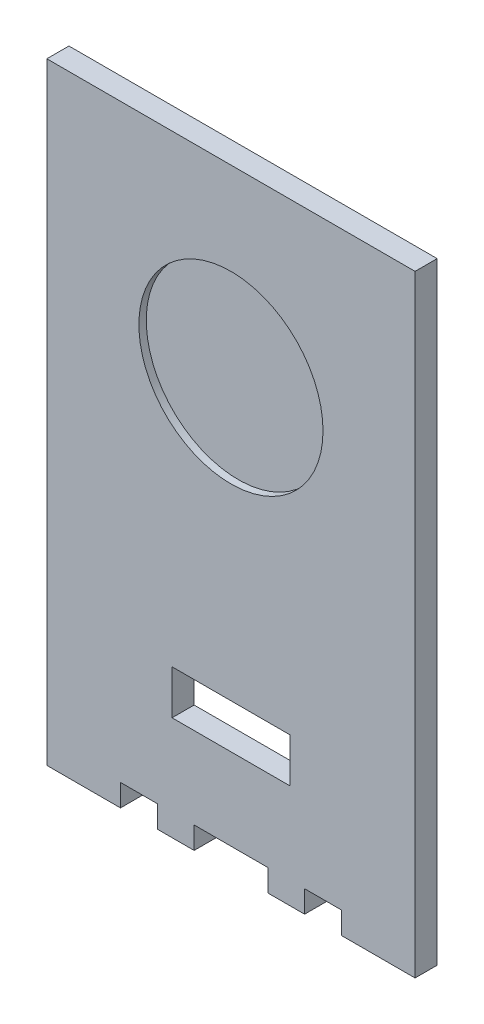
ISO-10303-21;
HEADER;
FILE_DESCRIPTION(('STEP AP214'),'2;1');
FILE_NAME('part.step','',(''),(''),'','','');
FILE_SCHEMA(('AUTOMOTIVE_DESIGN { 1 0 10303 214 1 1 1 1 }'));
ENDSEC;
DATA;
#1=APPLICATION_CONTEXT('core data for automotive mechanical design processes');
#2=APPLICATION_PROTOCOL_DEFINITION('international standard','automotive_design',2000,#1);
#3=PRODUCT_CONTEXT('',#1,'mechanical');
#4=PRODUCT('Part','Part','',(#3));
#5=PRODUCT_RELATED_PRODUCT_CATEGORY('part','',(#4));
#6=PRODUCT_DEFINITION_FORMATION('','',#4);
#7=PRODUCT_DEFINITION_CONTEXT('part definition',#1,'design');
#8=PRODUCT_DEFINITION('design','',#6,#7);
#9=PRODUCT_DEFINITION_SHAPE('','',#8);
#10=(LENGTH_UNIT() NAMED_UNIT(*) SI_UNIT(.MILLI.,.METRE.));
#11=(NAMED_UNIT(*) PLANE_ANGLE_UNIT() SI_UNIT($,.RADIAN.));
#12=(NAMED_UNIT(*) SI_UNIT($,.STERADIAN.) SOLID_ANGLE_UNIT());
#13=UNCERTAINTY_MEASURE_WITH_UNIT(LENGTH_MEASURE(1.E-05),#10,'distance_accuracy_value','');
#14=(GEOMETRIC_REPRESENTATION_CONTEXT(3) GLOBAL_UNCERTAINTY_ASSIGNED_CONTEXT((#13)) GLOBAL_UNIT_ASSIGNED_CONTEXT((#10,
#11,#12)) REPRESENTATION_CONTEXT('',''));
#15=CARTESIAN_POINT('',(0.,0.,0.));
#16=DIRECTION('',(0.,0.,1.));
#17=DIRECTION('',(1.,0.,0.));
#18=AXIS2_PLACEMENT_3D('',#15,#16,#17);
#19=CARTESIAN_POINT('',(0.,0.,3.));
#20=DIRECTION('',(0.,0.,-1.));
#21=DIRECTION('',(-1.,0.,0.));
#22=AXIS2_PLACEMENT_3D('',#19,#20,#21);
#23=PLANE('',#22);
#24=CARTESIAN_POINT('',(1.87350135405495E-13,25.0000000000001,3.));
#25=DIRECTION('',(0.,0.,1.));
#26=DIRECTION('',(1.,0.,0.));
#27=AXIS2_PLACEMENT_3D('',#24,#25,#26);
#28=CIRCLE('',#27,12.5);
#29=CARTESIAN_POINT('',(12.5000000000002,25.0000000000001,3.));
#30=VERTEX_POINT('',#29);
#31=EDGE_CURVE('E334',#30,#30,#28,.T.);
#32=ORIENTED_EDGE('',*,*,#31,.F.);
#33=EDGE_LOOP('',(#32));
#34=FACE_BOUND('',#33,.T.);
#35=DIRECTION('',(-1.,0.,0.));
#36=VECTOR('',#35,1.);
#37=CARTESIAN_POINT('',(0.,50.,3.));
#38=LINE('',#37,#36);
#39=CARTESIAN_POINT('',(25.,50.,3.));
#40=VERTEX_POINT('',#39);
#41=CARTESIAN_POINT('',(-25.,50.,3.));
#42=VERTEX_POINT('',#41);
#43=EDGE_CURVE('E106',#40,#42,#38,.T.);
#44=ORIENTED_EDGE('',*,*,#43,.T.);
#45=DIRECTION('',(0.,-1.,0.));
#46=VECTOR('',#45,1.);
#47=CARTESIAN_POINT('',(-25.,0.,3.));
#48=LINE('',#47,#46);
#49=CARTESIAN_POINT('',(-25.,-33.1,3.));
#50=VERTEX_POINT('',#49);
#51=EDGE_CURVE('E95',#42,#50,#48,.T.);
#52=ORIENTED_EDGE('',*,*,#51,.T.);
#53=DIRECTION('',(1.,0.,0.));
#54=VECTOR('',#53,1.);
#55=CARTESIAN_POINT('',(-20.,-33.1,3.));
#56=LINE('',#55,#54);
#57=CARTESIAN_POINT('',(-15.,-33.1,3.));
#58=VERTEX_POINT('',#57);
#59=EDGE_CURVE('E105',#50,#58,#56,.T.);
#60=ORIENTED_EDGE('',*,*,#59,.T.);
#61=DIRECTION('',(0.,1.,0.));
#62=VECTOR('',#61,1.);
#63=CARTESIAN_POINT('',(-15.,-30.1,3.));
#64=LINE('',#63,#62);
#65=CARTESIAN_POINT('',(-15.,-30.1,3.));
#66=VERTEX_POINT('',#65);
#67=EDGE_CURVE('E288',#58,#66,#64,.T.);
#68=ORIENTED_EDGE('',*,*,#67,.T.);
#69=DIRECTION('',(1.,0.,0.));
#70=VECTOR('',#69,1.);
#71=CARTESIAN_POINT('',(-15.,-30.1,3.));
#72=LINE('',#71,#70);
#73=CARTESIAN_POINT('',(-10.,-30.1,3.));
#74=VERTEX_POINT('',#73);
#75=EDGE_CURVE('E284',#66,#74,#72,.T.);
#76=ORIENTED_EDGE('',*,*,#75,.T.);
#77=DIRECTION('',(0.,-1.,0.));
#78=VECTOR('',#77,1.);
#79=CARTESIAN_POINT('',(-10.,-30.1,3.));
#80=LINE('',#79,#78);
#81=CARTESIAN_POINT('',(-10.,-33.1,3.));
#82=VERTEX_POINT('',#81);
#83=EDGE_CURVE('E280',#74,#82,#80,.T.);
#84=ORIENTED_EDGE('',*,*,#83,.T.);
#85=DIRECTION('',(1.,0.,0.));
#86=VECTOR('',#85,1.);
#87=CARTESIAN_POINT('',(-10.,-33.1,3.));
#88=LINE('',#87,#86);
#89=CARTESIAN_POINT('',(-5.,-33.1,3.));
#90=VERTEX_POINT('',#89);
#91=EDGE_CURVE('E276',#82,#90,#88,.T.);
#92=ORIENTED_EDGE('',*,*,#91,.T.);
#93=DIRECTION('',(0.,1.,0.));
#94=VECTOR('',#93,1.);
#95=CARTESIAN_POINT('',(-5.,-30.1,3.));
#96=LINE('',#95,#94);
#97=CARTESIAN_POINT('',(-5.,-30.1,3.));
#98=VERTEX_POINT('',#97);
#99=EDGE_CURVE('E272',#90,#98,#96,.T.);
#100=ORIENTED_EDGE('',*,*,#99,.T.);
#101=DIRECTION('',(1.,0.,0.));
#102=VECTOR('',#101,1.);
#103=CARTESIAN_POINT('',(-5.,-30.1,3.));
#104=LINE('',#103,#102);
#105=CARTESIAN_POINT('',(5.,-30.1,3.));
#106=VERTEX_POINT('',#105);
#107=EDGE_CURVE('E268',#98,#106,#104,.T.);
#108=ORIENTED_EDGE('',*,*,#107,.T.);
#109=DIRECTION('',(0.,-1.,0.));
#110=VECTOR('',#109,1.);
#111=CARTESIAN_POINT('',(5.,-30.1,3.));
#112=LINE('',#111,#110);
#113=CARTESIAN_POINT('',(5.,-33.1,3.));
#114=VERTEX_POINT('',#113);
#115=EDGE_CURVE('E264',#106,#114,#112,.T.);
#116=ORIENTED_EDGE('',*,*,#115,.T.);
#117=DIRECTION('',(1.,0.,0.));
#118=VECTOR('',#117,1.);
#119=CARTESIAN_POINT('',(10.,-33.1,3.));
#120=LINE('',#119,#118);
#121=CARTESIAN_POINT('',(10.,-33.1,3.));
#122=VERTEX_POINT('',#121);
#123=EDGE_CURVE('E260',#114,#122,#120,.T.);
#124=ORIENTED_EDGE('',*,*,#123,.T.);
#125=DIRECTION('',(0.,1.,0.));
#126=VECTOR('',#125,1.);
#127=CARTESIAN_POINT('',(10.,-30.1,3.));
#128=LINE('',#127,#126);
#129=CARTESIAN_POINT('',(10.,-30.1,3.));
#130=VERTEX_POINT('',#129);
#131=EDGE_CURVE('E256',#122,#130,#128,.T.);
#132=ORIENTED_EDGE('',*,*,#131,.T.);
#133=DIRECTION('',(1.,0.,0.));
#134=VECTOR('',#133,1.);
#135=CARTESIAN_POINT('',(10.,-30.1,3.));
#136=LINE('',#135,#134);
#137=CARTESIAN_POINT('',(15.,-30.1,3.));
#138=VERTEX_POINT('',#137);
#139=EDGE_CURVE('E252',#130,#138,#136,.T.);
#140=ORIENTED_EDGE('',*,*,#139,.T.);
#141=DIRECTION('',(0.,-1.,0.));
#142=VECTOR('',#141,1.);
#143=CARTESIAN_POINT('',(15.,-30.1,3.));
#144=LINE('',#143,#142);
#145=CARTESIAN_POINT('',(15.,-33.1,3.));
#146=VERTEX_POINT('',#145);
#147=EDGE_CURVE('E146',#138,#146,#144,.T.);
#148=ORIENTED_EDGE('',*,*,#147,.T.);
#149=DIRECTION('',(1.,0.,0.));
#150=VECTOR('',#149,1.);
#151=CARTESIAN_POINT('',(20.,-33.1,3.));
#152=LINE('',#151,#150);
#153=CARTESIAN_POINT('',(25.,-33.1,3.));
#154=VERTEX_POINT('',#153);
#155=EDGE_CURVE('E143',#146,#154,#152,.T.);
#156=ORIENTED_EDGE('',*,*,#155,.T.);
#157=DIRECTION('',(0.,1.,0.));
#158=VECTOR('',#157,1.);
#159=CARTESIAN_POINT('',(25.,0.,3.));
#160=LINE('',#159,#158);
#161=EDGE_CURVE('E111',#154,#40,#160,.T.);
#162=ORIENTED_EDGE('',*,*,#161,.T.);
#163=EDGE_LOOP('',(#44,#52,#60,#68,#76,#84,#92,#100,#108,#116,#124,#132,#140,#148,#156,#162));
#164=FACE_BOUND('',#163,.T.);
#165=DIRECTION('',(0.,-1.,0.));
#166=VECTOR('',#165,1.);
#167=CARTESIAN_POINT('',(-8.,-13.,3.));
#168=LINE('',#167,#166);
#169=CARTESIAN_POINT('',(-8.,-13.,3.));
#170=VERTEX_POINT('',#169);
#171=CARTESIAN_POINT('',(-8.,-19.,3.));
#172=VERTEX_POINT('',#171);
#173=EDGE_CURVE('E308',#170,#172,#168,.T.);
#174=ORIENTED_EDGE('',*,*,#173,.F.);
#175=DIRECTION('',(-1.,0.,0.));
#176=VECTOR('',#175,1.);
#177=CARTESIAN_POINT('',(-8.,-13.,3.));
#178=LINE('',#177,#176);
#179=CARTESIAN_POINT('',(8.,-13.,3.));
#180=VERTEX_POINT('',#179);
#181=EDGE_CURVE('E303',#180,#170,#178,.T.);
#182=ORIENTED_EDGE('',*,*,#181,.F.);
#183=DIRECTION('',(0.,1.,0.));
#184=VECTOR('',#183,1.);
#185=CARTESIAN_POINT('',(8.,-13.,3.));
#186=LINE('',#185,#184);
#187=CARTESIAN_POINT('',(8.,-19.,3.));
#188=VERTEX_POINT('',#187);
#189=EDGE_CURVE('E324',#188,#180,#186,.T.);
#190=ORIENTED_EDGE('',*,*,#189,.F.);
#191=DIRECTION('',(1.,0.,0.));
#192=VECTOR('',#191,1.);
#193=CARTESIAN_POINT('',(-8.,-19.,3.));
#194=LINE('',#193,#192);
#195=EDGE_CURVE('E327',#172,#188,#194,.T.);
#196=ORIENTED_EDGE('',*,*,#195,.F.);
#197=EDGE_LOOP('',(#174,#182,#190,#196));
#198=FACE_BOUND('',#197,.T.);
#199=ADVANCED_FACE('F46',(#34,#164,#198),#23,.F.);
#200=CARTESIAN_POINT('',(0.,0.,0.));
#201=DIRECTION('',(0.,0.,-1.));
#202=DIRECTION('',(-1.,0.,0.));
#203=AXIS2_PLACEMENT_3D('',#200,#201,#202);
#204=PLANE('',#203);
#205=DIRECTION('',(-1.,0.,0.));
#206=VECTOR('',#205,1.);
#207=CARTESIAN_POINT('',(0.,50.,0.));
#208=LINE('',#207,#206);
#209=CARTESIAN_POINT('',(25.,50.,0.));
#210=VERTEX_POINT('',#209);
#211=CARTESIAN_POINT('',(-25.,50.,0.));
#212=VERTEX_POINT('',#211);
#213=EDGE_CURVE('E118',#210,#212,#208,.T.);
#214=ORIENTED_EDGE('',*,*,#213,.F.);
#215=DIRECTION('',(0.,1.,0.));
#216=VECTOR('',#215,1.);
#217=CARTESIAN_POINT('',(25.,0.,0.));
#218=LINE('',#217,#216);
#219=CARTESIAN_POINT('',(25.,-33.1,0.));
#220=VERTEX_POINT('',#219);
#221=EDGE_CURVE('E116',#220,#210,#218,.T.);
#222=ORIENTED_EDGE('',*,*,#221,.F.);
#223=DIRECTION('',(1.,0.,0.));
#224=VECTOR('',#223,1.);
#225=CARTESIAN_POINT('',(20.,-33.1,0.));
#226=LINE('',#225,#224);
#227=CARTESIAN_POINT('',(15.,-33.1,0.));
#228=VERTEX_POINT('',#227);
#229=EDGE_CURVE('E151',#228,#220,#226,.T.);
#230=ORIENTED_EDGE('',*,*,#229,.F.);
#231=DIRECTION('',(0.,-1.,0.));
#232=VECTOR('',#231,1.);
#233=CARTESIAN_POINT('',(15.,-30.1,0.));
#234=LINE('',#233,#232);
#235=CARTESIAN_POINT('',(15.,-30.1,0.));
#236=VERTEX_POINT('',#235);
#237=EDGE_CURVE('E202',#236,#228,#234,.T.);
#238=ORIENTED_EDGE('',*,*,#237,.F.);
#239=DIRECTION('',(1.,0.,0.));
#240=VECTOR('',#239,1.);
#241=CARTESIAN_POINT('',(10.,-30.1,0.));
#242=LINE('',#241,#240);
#243=CARTESIAN_POINT('',(10.,-30.1,0.));
#244=VERTEX_POINT('',#243);
#245=EDGE_CURVE('E206',#244,#236,#242,.T.);
#246=ORIENTED_EDGE('',*,*,#245,.F.);
#247=DIRECTION('',(0.,1.,0.));
#248=VECTOR('',#247,1.);
#249=CARTESIAN_POINT('',(10.,-30.1,0.));
#250=LINE('',#249,#248);
#251=CARTESIAN_POINT('',(10.,-33.1,0.));
#252=VERTEX_POINT('',#251);
#253=EDGE_CURVE('E210',#252,#244,#250,.T.);
#254=ORIENTED_EDGE('',*,*,#253,.F.);
#255=DIRECTION('',(1.,0.,0.));
#256=VECTOR('',#255,1.);
#257=CARTESIAN_POINT('',(10.,-33.1,0.));
#258=LINE('',#257,#256);
#259=CARTESIAN_POINT('',(5.,-33.1,0.));
#260=VERTEX_POINT('',#259);
#261=EDGE_CURVE('E214',#260,#252,#258,.T.);
#262=ORIENTED_EDGE('',*,*,#261,.F.);
#263=DIRECTION('',(0.,-1.,0.));
#264=VECTOR('',#263,1.);
#265=CARTESIAN_POINT('',(5.,-30.1,0.));
#266=LINE('',#265,#264);
#267=CARTESIAN_POINT('',(5.,-30.1,0.));
#268=VERTEX_POINT('',#267);
#269=EDGE_CURVE('E218',#268,#260,#266,.T.);
#270=ORIENTED_EDGE('',*,*,#269,.F.);
#271=DIRECTION('',(1.,0.,0.));
#272=VECTOR('',#271,1.);
#273=CARTESIAN_POINT('',(-5.,-30.1,0.));
#274=LINE('',#273,#272);
#275=CARTESIAN_POINT('',(-5.,-30.1,0.));
#276=VERTEX_POINT('',#275);
#277=EDGE_CURVE('E222',#276,#268,#274,.T.);
#278=ORIENTED_EDGE('',*,*,#277,.F.);
#279=DIRECTION('',(0.,1.,0.));
#280=VECTOR('',#279,1.);
#281=CARTESIAN_POINT('',(-5.,-30.1,0.));
#282=LINE('',#281,#280);
#283=CARTESIAN_POINT('',(-5.,-33.1,0.));
#284=VERTEX_POINT('',#283);
#285=EDGE_CURVE('E226',#284,#276,#282,.T.);
#286=ORIENTED_EDGE('',*,*,#285,.F.);
#287=DIRECTION('',(1.,0.,0.));
#288=VECTOR('',#287,1.);
#289=CARTESIAN_POINT('',(-10.,-33.1,0.));
#290=LINE('',#289,#288);
#291=CARTESIAN_POINT('',(-10.,-33.1,0.));
#292=VERTEX_POINT('',#291);
#293=EDGE_CURVE('E230',#292,#284,#290,.T.);
#294=ORIENTED_EDGE('',*,*,#293,.F.);
#295=DIRECTION('',(0.,-1.,0.));
#296=VECTOR('',#295,1.);
#297=CARTESIAN_POINT('',(-10.,-30.1,0.));
#298=LINE('',#297,#296);
#299=CARTESIAN_POINT('',(-10.,-30.1,0.));
#300=VERTEX_POINT('',#299);
#301=EDGE_CURVE('E234',#300,#292,#298,.T.);
#302=ORIENTED_EDGE('',*,*,#301,.F.);
#303=DIRECTION('',(1.,0.,0.));
#304=VECTOR('',#303,1.);
#305=CARTESIAN_POINT('',(-15.,-30.1,0.));
#306=LINE('',#305,#304);
#307=CARTESIAN_POINT('',(-15.,-30.1,0.));
#308=VERTEX_POINT('',#307);
#309=EDGE_CURVE('E238',#308,#300,#306,.T.);
#310=ORIENTED_EDGE('',*,*,#309,.F.);
#311=DIRECTION('',(0.,1.,0.));
#312=VECTOR('',#311,1.);
#313=CARTESIAN_POINT('',(-15.,-30.1,0.));
#314=LINE('',#313,#312);
#315=CARTESIAN_POINT('',(-15.,-33.1,0.));
#316=VERTEX_POINT('',#315);
#317=EDGE_CURVE('E242',#316,#308,#314,.T.);
#318=ORIENTED_EDGE('',*,*,#317,.F.);
#319=DIRECTION('',(1.,0.,0.));
#320=VECTOR('',#319,1.);
#321=CARTESIAN_POINT('',(-20.,-33.1,0.));
#322=LINE('',#321,#320);
#323=CARTESIAN_POINT('',(-25.,-33.1,0.));
#324=VERTEX_POINT('',#323);
#325=EDGE_CURVE('E129',#324,#316,#322,.T.);
#326=ORIENTED_EDGE('',*,*,#325,.F.);
#327=DIRECTION('',(0.,-1.,0.));
#328=VECTOR('',#327,1.);
#329=CARTESIAN_POINT('',(-25.,0.,0.));
#330=LINE('',#329,#328);
#331=EDGE_CURVE('E124',#212,#324,#330,.T.);
#332=ORIENTED_EDGE('',*,*,#331,.F.);
#333=EDGE_LOOP('',(#214,#222,#230,#238,#246,#254,#262,#270,#278,#286,#294,#302,#310,#318,#326,#332));
#334=FACE_BOUND('',#333,.T.);
#335=DIRECTION('',(-1.,0.,0.));
#336=VECTOR('',#335,1.);
#337=CARTESIAN_POINT('',(-8.,-13.,0.));
#338=LINE('',#337,#336);
#339=CARTESIAN_POINT('',(8.,-13.,0.));
#340=VERTEX_POINT('',#339);
#341=CARTESIAN_POINT('',(-8.,-13.,0.));
#342=VERTEX_POINT('',#341);
#343=EDGE_CURVE('E304',#340,#342,#338,.T.);
#344=ORIENTED_EDGE('',*,*,#343,.T.);
#345=DIRECTION('',(0.,-1.,0.));
#346=VECTOR('',#345,1.);
#347=CARTESIAN_POINT('',(-8.,-13.,0.));
#348=LINE('',#347,#346);
#349=CARTESIAN_POINT('',(-8.,-19.,0.));
#350=VERTEX_POINT('',#349);
#351=EDGE_CURVE('E317',#342,#350,#348,.T.);
#352=ORIENTED_EDGE('',*,*,#351,.T.);
#353=DIRECTION('',(1.,0.,0.));
#354=VECTOR('',#353,1.);
#355=CARTESIAN_POINT('',(-8.,-19.,0.));
#356=LINE('',#355,#354);
#357=CARTESIAN_POINT('',(8.,-19.,0.));
#358=VERTEX_POINT('',#357);
#359=EDGE_CURVE('E313',#350,#358,#356,.T.);
#360=ORIENTED_EDGE('',*,*,#359,.T.);
#361=DIRECTION('',(0.,1.,0.));
#362=VECTOR('',#361,1.);
#363=CARTESIAN_POINT('',(8.,-13.,0.));
#364=LINE('',#363,#362);
#365=EDGE_CURVE('E309',#358,#340,#364,.T.);
#366=ORIENTED_EDGE('',*,*,#365,.T.);
#367=EDGE_LOOP('',(#344,#352,#360,#366));
#368=FACE_BOUND('',#367,.T.);
#369=ADVANCED_FACE('F352',(#334,#368),#204,.T.);
#370=CARTESIAN_POINT('',(-20.,50.,3.));
#371=DIRECTION('',(0.,-1.,0.));
#372=DIRECTION('',(0.,0.,-1.));
#373=AXIS2_PLACEMENT_3D('',#370,#371,#372);
#374=PLANE('',#373);
#375=ORIENTED_EDGE('',*,*,#213,.T.);
#376=DIRECTION('',(0.,0.,-1.));
#377=VECTOR('',#376,1.);
#378=CARTESIAN_POINT('',(-25.,50.,3.));
#379=LINE('',#378,#377);
#380=EDGE_CURVE('E12',#42,#212,#379,.T.);
#381=ORIENTED_EDGE('',*,*,#380,.F.);
#382=ORIENTED_EDGE('',*,*,#43,.F.);
#383=DIRECTION('',(0.,0.,-1.));
#384=VECTOR('',#383,1.);
#385=CARTESIAN_POINT('',(25.,50.,3.));
#386=LINE('',#385,#384);
#387=EDGE_CURVE('E119',#40,#210,#386,.T.);
#388=ORIENTED_EDGE('',*,*,#387,.T.);
#389=EDGE_LOOP('',(#375,#381,#382,#388));
#390=FACE_BOUND('',#389,.T.);
#391=ADVANCED_FACE('F48',(#390),#374,.F.);
#392=CARTESIAN_POINT('',(-25.,-30.1,3.));
#393=DIRECTION('',(1.,0.,0.));
#394=DIRECTION('',(0.,0.,-1.));
#395=AXIS2_PLACEMENT_3D('',#392,#393,#394);
#396=PLANE('',#395);
#397=ORIENTED_EDGE('',*,*,#331,.T.);
#398=DIRECTION('',(0.,0.,-1.));
#399=VECTOR('',#398,1.);
#400=CARTESIAN_POINT('',(-25.,-33.1,3.));
#401=LINE('',#400,#399);
#402=EDGE_CURVE('E56',#50,#324,#401,.T.);
#403=ORIENTED_EDGE('',*,*,#402,.F.);
#404=ORIENTED_EDGE('',*,*,#51,.F.);
#405=ORIENTED_EDGE('',*,*,#380,.T.);
#406=EDGE_LOOP('',(#397,#403,#404,#405));
#407=FACE_BOUND('',#406,.T.);
#408=ADVANCED_FACE('F97',(#407),#396,.F.);
#409=CARTESIAN_POINT('',(-20.,-33.1,3.));
#410=DIRECTION('',(0.,1.,0.));
#411=DIRECTION('',(0.,0.,1.));
#412=AXIS2_PLACEMENT_3D('',#409,#410,#411);
#413=PLANE('',#412);
#414=ORIENTED_EDGE('',*,*,#325,.T.);
#415=DIRECTION('',(0.,0.,-1.));
#416=VECTOR('',#415,1.);
#417=CARTESIAN_POINT('',(-15.,-33.1,3.));
#418=LINE('',#417,#416);
#419=EDGE_CURVE('E152',#58,#316,#418,.T.);
#420=ORIENTED_EDGE('',*,*,#419,.F.);
#421=ORIENTED_EDGE('',*,*,#59,.F.);
#422=ORIENTED_EDGE('',*,*,#402,.T.);
#423=EDGE_LOOP('',(#414,#420,#421,#422));
#424=FACE_BOUND('',#423,.T.);
#425=ADVANCED_FACE('F411',(#424),#413,.F.);
#426=CARTESIAN_POINT('',(-15.,-30.1,3.));
#427=DIRECTION('',(-1.,0.,0.));
#428=DIRECTION('',(0.,0.,1.));
#429=AXIS2_PLACEMENT_3D('',#426,#427,#428);
#430=PLANE('',#429);
#431=ORIENTED_EDGE('',*,*,#317,.T.);
#432=DIRECTION('',(0.,0.,-1.));
#433=VECTOR('',#432,1.);
#434=CARTESIAN_POINT('',(-15.,-30.1,3.));
#435=LINE('',#434,#433);
#436=EDGE_CURVE('E156',#66,#308,#435,.T.);
#437=ORIENTED_EDGE('',*,*,#436,.F.);
#438=ORIENTED_EDGE('',*,*,#67,.F.);
#439=ORIENTED_EDGE('',*,*,#419,.T.);
#440=EDGE_LOOP('',(#431,#437,#438,#439));
#441=FACE_BOUND('',#440,.T.);
#442=ADVANCED_FACE('F407',(#441),#430,.F.);
#443=CARTESIAN_POINT('',(-15.,-30.1,3.));
#444=DIRECTION('',(0.,1.,0.));
#445=DIRECTION('',(0.,0.,1.));
#446=AXIS2_PLACEMENT_3D('',#443,#444,#445);
#447=PLANE('',#446);
#448=ORIENTED_EDGE('',*,*,#309,.T.);
#449=DIRECTION('',(0.,0.,-1.));
#450=VECTOR('',#449,1.);
#451=CARTESIAN_POINT('',(-10.,-30.1,3.));
#452=LINE('',#451,#450);
#453=EDGE_CURVE('E160',#74,#300,#452,.T.);
#454=ORIENTED_EDGE('',*,*,#453,.F.);
#455=ORIENTED_EDGE('',*,*,#75,.F.);
#456=ORIENTED_EDGE('',*,*,#436,.T.);
#457=EDGE_LOOP('',(#448,#454,#455,#456));
#458=FACE_BOUND('',#457,.T.);
#459=ADVANCED_FACE('F403',(#458),#447,.F.);
#460=CARTESIAN_POINT('',(-10.,-30.1,3.));
#461=DIRECTION('',(1.,0.,0.));
#462=DIRECTION('',(0.,1.,0.));
#463=AXIS2_PLACEMENT_3D('',#460,#461,#462);
#464=PLANE('',#463);
#465=ORIENTED_EDGE('',*,*,#301,.T.);
#466=DIRECTION('',(0.,0.,-1.));
#467=VECTOR('',#466,1.);
#468=CARTESIAN_POINT('',(-10.,-33.1,3.));
#469=LINE('',#468,#467);
#470=EDGE_CURVE('E164',#82,#292,#469,.T.);
#471=ORIENTED_EDGE('',*,*,#470,.F.);
#472=ORIENTED_EDGE('',*,*,#83,.F.);
#473=ORIENTED_EDGE('',*,*,#453,.T.);
#474=EDGE_LOOP('',(#465,#471,#472,#473));
#475=FACE_BOUND('',#474,.T.);
#476=ADVANCED_FACE('F399',(#475),#464,.F.);
#477=CARTESIAN_POINT('',(-10.,-33.1,3.));
#478=DIRECTION('',(0.,1.,0.));
#479=DIRECTION('',(-1.,0.,0.));
#480=AXIS2_PLACEMENT_3D('',#477,#478,#479);
#481=PLANE('',#480);
#482=ORIENTED_EDGE('',*,*,#293,.T.);
#483=DIRECTION('',(0.,0.,-1.));
#484=VECTOR('',#483,1.);
#485=CARTESIAN_POINT('',(-5.,-33.1,3.));
#486=LINE('',#485,#484);
#487=EDGE_CURVE('E168',#90,#284,#486,.T.);
#488=ORIENTED_EDGE('',*,*,#487,.F.);
#489=ORIENTED_EDGE('',*,*,#91,.F.);
#490=ORIENTED_EDGE('',*,*,#470,.T.);
#491=EDGE_LOOP('',(#482,#488,#489,#490));
#492=FACE_BOUND('',#491,.T.);
#493=ADVANCED_FACE('F395',(#492),#481,.F.);
#494=CARTESIAN_POINT('',(-5.,-30.1,3.));
#495=DIRECTION('',(-1.,0.,0.));
#496=DIRECTION('',(0.,0.,1.));
#497=AXIS2_PLACEMENT_3D('',#494,#495,#496);
#498=PLANE('',#497);
#499=ORIENTED_EDGE('',*,*,#285,.T.);
#500=DIRECTION('',(0.,0.,-1.));
#501=VECTOR('',#500,1.);
#502=CARTESIAN_POINT('',(-5.,-30.1,3.));
#503=LINE('',#502,#501);
#504=EDGE_CURVE('E172',#98,#276,#503,.T.);
#505=ORIENTED_EDGE('',*,*,#504,.F.);
#506=ORIENTED_EDGE('',*,*,#99,.F.);
#507=ORIENTED_EDGE('',*,*,#487,.T.);
#508=EDGE_LOOP('',(#499,#505,#506,#507));
#509=FACE_BOUND('',#508,.T.);
#510=ADVANCED_FACE('F391',(#509),#498,.F.);
#511=CARTESIAN_POINT('',(-5.,-30.1,3.));
#512=DIRECTION('',(0.,1.,0.));
#513=DIRECTION('',(0.,0.,1.));
#514=AXIS2_PLACEMENT_3D('',#511,#512,#513);
#515=PLANE('',#514);
#516=ORIENTED_EDGE('',*,*,#277,.T.);
#517=DIRECTION('',(0.,0.,-1.));
#518=VECTOR('',#517,1.);
#519=CARTESIAN_POINT('',(5.,-30.1,3.));
#520=LINE('',#519,#518);
#521=EDGE_CURVE('E176',#106,#268,#520,.T.);
#522=ORIENTED_EDGE('',*,*,#521,.F.);
#523=ORIENTED_EDGE('',*,*,#107,.F.);
#524=ORIENTED_EDGE('',*,*,#504,.T.);
#525=EDGE_LOOP('',(#516,#522,#523,#524));
#526=FACE_BOUND('',#525,.T.);
#527=ADVANCED_FACE('F387',(#526),#515,.F.);
#528=CARTESIAN_POINT('',(5.,-30.1,3.));
#529=DIRECTION('',(1.,0.,0.));
#530=DIRECTION('',(0.,0.,-1.));
#531=AXIS2_PLACEMENT_3D('',#528,#529,#530);
#532=PLANE('',#531);
#533=ORIENTED_EDGE('',*,*,#269,.T.);
#534=DIRECTION('',(0.,0.,-1.));
#535=VECTOR('',#534,1.);
#536=CARTESIAN_POINT('',(5.,-33.1,3.));
#537=LINE('',#536,#535);
#538=EDGE_CURVE('E180',#114,#260,#537,.T.);
#539=ORIENTED_EDGE('',*,*,#538,.F.);
#540=ORIENTED_EDGE('',*,*,#115,.F.);
#541=ORIENTED_EDGE('',*,*,#521,.T.);
#542=EDGE_LOOP('',(#533,#539,#540,#541));
#543=FACE_BOUND('',#542,.T.);
#544=ADVANCED_FACE('F383',(#543),#532,.F.);
#545=CARTESIAN_POINT('',(10.,-33.1,3.));
#546=DIRECTION('',(0.,1.,0.));
#547=DIRECTION('',(-1.,0.,0.));
#548=AXIS2_PLACEMENT_3D('',#545,#546,#547);
#549=PLANE('',#548);
#550=ORIENTED_EDGE('',*,*,#261,.T.);
#551=DIRECTION('',(0.,0.,-1.));
#552=VECTOR('',#551,1.);
#553=CARTESIAN_POINT('',(10.,-33.1,3.));
#554=LINE('',#553,#552);
#555=EDGE_CURVE('E184',#122,#252,#554,.T.);
#556=ORIENTED_EDGE('',*,*,#555,.F.);
#557=ORIENTED_EDGE('',*,*,#123,.F.);
#558=ORIENTED_EDGE('',*,*,#538,.T.);
#559=EDGE_LOOP('',(#550,#556,#557,#558));
#560=FACE_BOUND('',#559,.T.);
#561=ADVANCED_FACE('F379',(#560),#549,.F.);
#562=CARTESIAN_POINT('',(10.,-30.1,3.));
#563=DIRECTION('',(-1.,0.,0.));
#564=DIRECTION('',(0.,-1.,0.));
#565=AXIS2_PLACEMENT_3D('',#562,#563,#564);
#566=PLANE('',#565);
#567=ORIENTED_EDGE('',*,*,#253,.T.);
#568=DIRECTION('',(0.,0.,-1.));
#569=VECTOR('',#568,1.);
#570=CARTESIAN_POINT('',(10.,-30.1,3.));
#571=LINE('',#570,#569);
#572=EDGE_CURVE('E188',#130,#244,#571,.T.);
#573=ORIENTED_EDGE('',*,*,#572,.F.);
#574=ORIENTED_EDGE('',*,*,#131,.F.);
#575=ORIENTED_EDGE('',*,*,#555,.T.);
#576=EDGE_LOOP('',(#567,#573,#574,#575));
#577=FACE_BOUND('',#576,.T.);
#578=ADVANCED_FACE('F375',(#577),#566,.F.);
#579=CARTESIAN_POINT('',(10.,-30.1,3.));
#580=DIRECTION('',(0.,1.,0.));
#581=DIRECTION('',(0.,0.,1.));
#582=AXIS2_PLACEMENT_3D('',#579,#580,#581);
#583=PLANE('',#582);
#584=ORIENTED_EDGE('',*,*,#245,.T.);
#585=DIRECTION('',(0.,0.,-1.));
#586=VECTOR('',#585,1.);
#587=CARTESIAN_POINT('',(15.,-30.1,3.));
#588=LINE('',#587,#586);
#589=EDGE_CURVE('E192',#138,#236,#588,.T.);
#590=ORIENTED_EDGE('',*,*,#589,.F.);
#591=ORIENTED_EDGE('',*,*,#139,.F.);
#592=ORIENTED_EDGE('',*,*,#572,.T.);
#593=EDGE_LOOP('',(#584,#590,#591,#592));
#594=FACE_BOUND('',#593,.T.);
#595=ADVANCED_FACE('F371',(#594),#583,.F.);
#596=CARTESIAN_POINT('',(15.,-30.1,3.));
#597=DIRECTION('',(1.,0.,0.));
#598=DIRECTION('',(0.,0.,-1.));
#599=AXIS2_PLACEMENT_3D('',#596,#597,#598);
#600=PLANE('',#599);
#601=ORIENTED_EDGE('',*,*,#237,.T.);
#602=DIRECTION('',(0.,0.,-1.));
#603=VECTOR('',#602,1.);
#604=CARTESIAN_POINT('',(15.,-33.1,3.));
#605=LINE('',#604,#603);
#606=EDGE_CURVE('E141',#146,#228,#605,.T.);
#607=ORIENTED_EDGE('',*,*,#606,.F.);
#608=ORIENTED_EDGE('',*,*,#147,.F.);
#609=ORIENTED_EDGE('',*,*,#589,.T.);
#610=EDGE_LOOP('',(#601,#607,#608,#609));
#611=FACE_BOUND('',#610,.T.);
#612=ADVANCED_FACE('F367',(#611),#600,.F.);
#613=CARTESIAN_POINT('',(20.,-33.1,3.));
#614=DIRECTION('',(0.,1.,0.));
#615=DIRECTION('',(0.,0.,1.));
#616=AXIS2_PLACEMENT_3D('',#613,#614,#615);
#617=PLANE('',#616);
#618=ORIENTED_EDGE('',*,*,#229,.T.);
#619=DIRECTION('',(0.,0.,-1.));
#620=VECTOR('',#619,1.);
#621=CARTESIAN_POINT('',(25.,-33.1,3.));
#622=LINE('',#621,#620);
#623=EDGE_CURVE('E137',#154,#220,#622,.T.);
#624=ORIENTED_EDGE('',*,*,#623,.F.);
#625=ORIENTED_EDGE('',*,*,#155,.F.);
#626=ORIENTED_EDGE('',*,*,#606,.T.);
#627=EDGE_LOOP('',(#618,#624,#625,#626));
#628=FACE_BOUND('',#627,.T.);
#629=ADVANCED_FACE('F363',(#628),#617,.F.);
#630=CARTESIAN_POINT('',(25.,20.,3.));
#631=DIRECTION('',(-1.,0.,0.));
#632=DIRECTION('',(0.,0.,1.));
#633=AXIS2_PLACEMENT_3D('',#630,#631,#632);
#634=PLANE('',#633);
#635=ORIENTED_EDGE('',*,*,#221,.T.);
#636=ORIENTED_EDGE('',*,*,#387,.F.);
#637=ORIENTED_EDGE('',*,*,#161,.F.);
#638=ORIENTED_EDGE('',*,*,#623,.T.);
#639=EDGE_LOOP('',(#635,#636,#637,#638));
#640=FACE_BOUND('',#639,.T.);
#641=ADVANCED_FACE('F366',(#640),#634,.F.);
#642=CARTESIAN_POINT('',(-8.,-13.,3.));
#643=DIRECTION('',(1.,0.,0.));
#644=DIRECTION('',(0.,0.,-1.));
#645=AXIS2_PLACEMENT_3D('',#642,#643,#644);
#646=PLANE('',#645);
#647=ORIENTED_EDGE('',*,*,#351,.F.);
#648=DIRECTION('',(0.,0.,-1.));
#649=VECTOR('',#648,1.);
#650=CARTESIAN_POINT('',(-8.,-13.,3.));
#651=LINE('',#650,#649);
#652=EDGE_CURVE('E299',#170,#342,#651,.T.);
#653=ORIENTED_EDGE('',*,*,#652,.F.);
#654=ORIENTED_EDGE('',*,*,#173,.T.);
#655=DIRECTION('',(0.,0.,-1.));
#656=VECTOR('',#655,1.);
#657=CARTESIAN_POINT('',(-8.,-19.,3.));
#658=LINE('',#657,#656);
#659=EDGE_CURVE('E125',#172,#350,#658,.T.);
#660=ORIENTED_EDGE('',*,*,#659,.T.);
#661=EDGE_LOOP('',(#647,#653,#654,#660));
#662=FACE_BOUND('',#661,.T.);
#663=ADVANCED_FACE('F360',(#662),#646,.T.);
#664=CARTESIAN_POINT('',(-8.,-19.,3.));
#665=DIRECTION('',(0.,1.,0.));
#666=DIRECTION('',(0.,0.,1.));
#667=AXIS2_PLACEMENT_3D('',#664,#665,#666);
#668=PLANE('',#667);
#669=ORIENTED_EDGE('',*,*,#359,.F.);
#670=ORIENTED_EDGE('',*,*,#659,.F.);
#671=ORIENTED_EDGE('',*,*,#195,.T.);
#672=DIRECTION('',(0.,0.,-1.));
#673=VECTOR('',#672,1.);
#674=CARTESIAN_POINT('',(8.,-19.,3.));
#675=LINE('',#674,#673);
#676=EDGE_CURVE('E132',#188,#358,#675,.T.);
#677=ORIENTED_EDGE('',*,*,#676,.T.);
#678=EDGE_LOOP('',(#669,#670,#671,#677));
#679=FACE_BOUND('',#678,.T.);
#680=ADVANCED_FACE('F458',(#679),#668,.T.);
#681=CARTESIAN_POINT('',(8.,-13.,3.));
#682=DIRECTION('',(-1.,0.,0.));
#683=DIRECTION('',(0.,0.,1.));
#684=AXIS2_PLACEMENT_3D('',#681,#682,#683);
#685=PLANE('',#684);
#686=ORIENTED_EDGE('',*,*,#365,.F.);
#687=ORIENTED_EDGE('',*,*,#676,.F.);
#688=ORIENTED_EDGE('',*,*,#189,.T.);
#689=DIRECTION('',(0.,0.,-1.));
#690=VECTOR('',#689,1.);
#691=CARTESIAN_POINT('',(8.,-13.,3.));
#692=LINE('',#691,#690);
#693=EDGE_CURVE('E64',#180,#340,#692,.T.);
#694=ORIENTED_EDGE('',*,*,#693,.T.);
#695=EDGE_LOOP('',(#686,#687,#688,#694));
#696=FACE_BOUND('',#695,.T.);
#697=ADVANCED_FACE('F449',(#696),#685,.T.);
#698=CARTESIAN_POINT('',(-8.,-13.,3.));
#699=DIRECTION('',(0.,-1.,0.));
#700=DIRECTION('',(0.,0.,-1.));
#701=AXIS2_PLACEMENT_3D('',#698,#699,#700);
#702=PLANE('',#701);
#703=ORIENTED_EDGE('',*,*,#343,.F.);
#704=ORIENTED_EDGE('',*,*,#693,.F.);
#705=ORIENTED_EDGE('',*,*,#181,.T.);
#706=ORIENTED_EDGE('',*,*,#652,.T.);
#707=EDGE_LOOP('',(#703,#704,#705,#706));
#708=FACE_BOUND('',#707,.T.);
#709=ADVANCED_FACE('F347',(#708),#702,.T.);
#710=CARTESIAN_POINT('',(1.87350135405495E-13,25.0000000000001,2.));
#711=DIRECTION('',(0.,0.,1.));
#712=DIRECTION('',(1.,0.,0.));
#713=AXIS2_PLACEMENT_3D('',#710,#711,#712);
#714=CYLINDRICAL_SURFACE('',#713,12.5);
#715=CARTESIAN_POINT('',(1.87350135405495E-13,25.0000000000001,2.));
#716=DIRECTION('',(0.,0.,1.));
#717=DIRECTION('',(1.,0.,0.));
#718=AXIS2_PLACEMENT_3D('',#715,#716,#717);
#719=CIRCLE('',#718,12.5);
#720=CARTESIAN_POINT('',(12.5000000000002,25.0000000000001,2.));
#721=VERTEX_POINT('',#720);
#722=EDGE_CURVE('E321',#721,#721,#719,.T.);
#723=ORIENTED_EDGE('',*,*,#722,.F.);
#724=EDGE_LOOP('',(#723));
#725=FACE_BOUND('',#724,.T.);
#726=ORIENTED_EDGE('',*,*,#31,.T.);
#727=EDGE_LOOP('',(#726));
#728=FACE_BOUND('',#727,.T.);
#729=ADVANCED_FACE('F344',(#725,#728),#714,.F.);
#730=CARTESIAN_POINT('',(1.87350135405495E-13,25.0000000000001,2.));
#731=DIRECTION('',(0.,0.,1.));
#732=DIRECTION('',(1.,0.,0.));
#733=AXIS2_PLACEMENT_3D('',#730,#731,#732);
#734=PLANE('',#733);
#735=ORIENTED_EDGE('',*,*,#722,.T.);
#736=EDGE_LOOP('',(#735));
#737=FACE_BOUND('',#736,.T.);
#738=ADVANCED_FACE('F342',(#737),#734,.T.);
#739=CLOSED_SHELL('',(#199,#369,#391,#408,#425,#442,#459,#476,#493,#510,#527,#544,#561,#578,
#595,#612,#629,#641,#663,#680,#697,#709,#729,#738));
#740=MANIFOLD_SOLID_BREP('B2',#739);
#741=ADVANCED_BREP_SHAPE_REPRESENTATION('',(#18,#740),#14);
#742=SHAPE_DEFINITION_REPRESENTATION(#9,#741);
ENDSEC;
END-ISO-10303-21;
